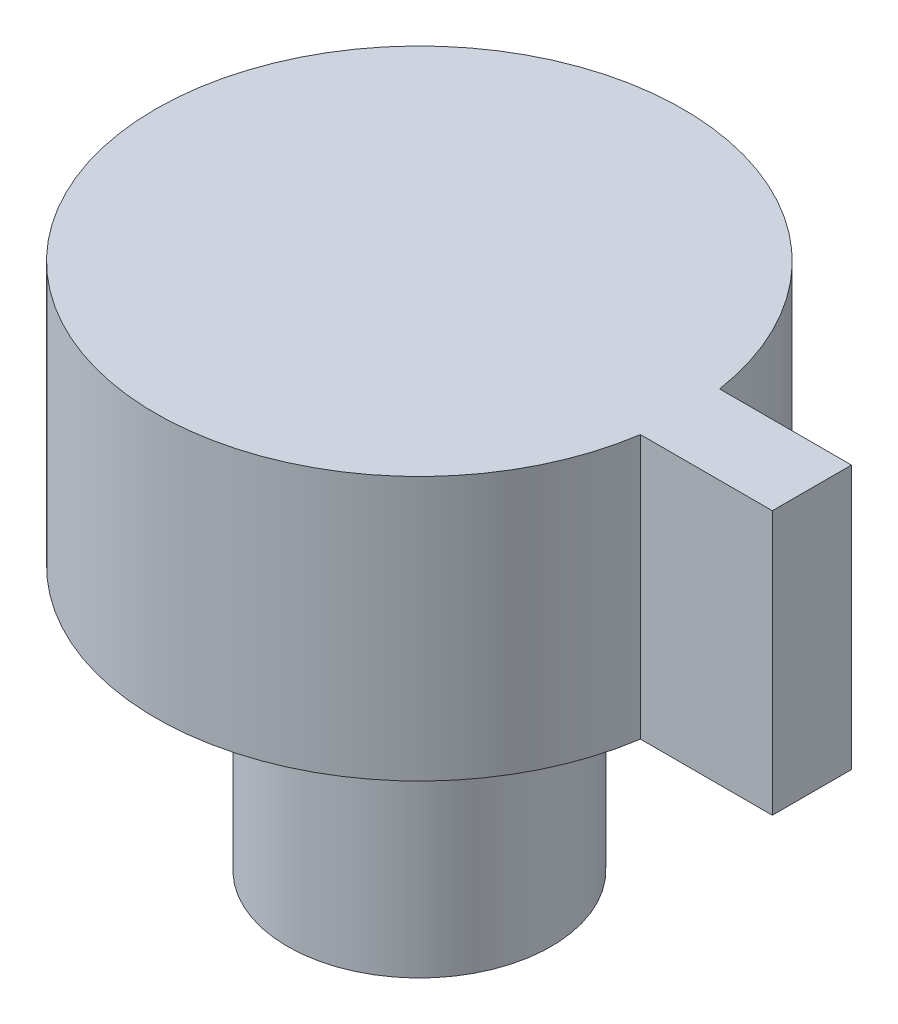
ISO-10303-21;
HEADER;
FILE_DESCRIPTION(('STEP AP214'),'2;1');
FILE_NAME('part.step','',(''),(''),'','','');
FILE_SCHEMA(('AUTOMOTIVE_DESIGN { 1 0 10303 214 1 1 1 1 }'));
ENDSEC;
DATA;
#1=APPLICATION_CONTEXT('core data for automotive mechanical design processes');
#2=APPLICATION_PROTOCOL_DEFINITION('international standard','automotive_design',2000,#1);
#3=PRODUCT_CONTEXT('',#1,'mechanical');
#4=PRODUCT('Part','Part','',(#3));
#5=PRODUCT_RELATED_PRODUCT_CATEGORY('part','',(#4));
#6=PRODUCT_DEFINITION_FORMATION('','',#4);
#7=PRODUCT_DEFINITION_CONTEXT('part definition',#1,'design');
#8=PRODUCT_DEFINITION('design','',#6,#7);
#9=PRODUCT_DEFINITION_SHAPE('','',#8);
#10=(LENGTH_UNIT() NAMED_UNIT(*) SI_UNIT(.MILLI.,.METRE.));
#11=(NAMED_UNIT(*) PLANE_ANGLE_UNIT() SI_UNIT($,.RADIAN.));
#12=(NAMED_UNIT(*) SI_UNIT($,.STERADIAN.) SOLID_ANGLE_UNIT());
#13=UNCERTAINTY_MEASURE_WITH_UNIT(LENGTH_MEASURE(1.E-05),#10,'distance_accuracy_value','');
#14=(GEOMETRIC_REPRESENTATION_CONTEXT(3) GLOBAL_UNCERTAINTY_ASSIGNED_CONTEXT((#13)) GLOBAL_UNIT_ASSIGNED_CONTEXT((#10,
#11,#12)) REPRESENTATION_CONTEXT('',''));
#15=CARTESIAN_POINT('',(0.,0.,0.));
#16=DIRECTION('',(0.,0.,1.));
#17=DIRECTION('',(1.,0.,0.));
#18=AXIS2_PLACEMENT_3D('',#15,#16,#17);
#19=CARTESIAN_POINT('',(0.,10.,16.2142782623037));
#20=DIRECTION('',(0.,0.,-1.));
#21=DIRECTION('',(-1.,0.,0.));
#22=AXIS2_PLACEMENT_3D('',#19,#20,#21);
#23=PLANE('',#22);
#24=DIRECTION('',(1.,0.,0.));
#25=VECTOR('',#24,1.);
#26=CARTESIAN_POINT('',(0.,0.,16.2142782623037));
#27=LINE('',#26,#25);
#28=CARTESIAN_POINT('',(-56.1699813359462,0.,16.2142782623037));
#29=VERTEX_POINT('',#28);
#30=CARTESIAN_POINT('',(-51.1699813359462,0.,16.2142782623037));
#31=VERTEX_POINT('',#30);
#32=EDGE_CURVE('E97',#29,#31,#27,.T.);
#33=ORIENTED_EDGE('',*,*,#32,.F.);
#34=DIRECTION('',(0.,-1.,0.));
#35=VECTOR('',#34,1.);
#36=CARTESIAN_POINT('',(-56.1699813359462,10.,16.2142782623037));
#37=LINE('',#36,#35);
#38=CARTESIAN_POINT('',(-56.1699813359462,10.,16.2142782623037));
#39=VERTEX_POINT('',#38);
#40=EDGE_CURVE('E11',#39,#29,#37,.T.);
#41=ORIENTED_EDGE('',*,*,#40,.F.);
#42=DIRECTION('',(1.,0.,0.));
#43=VECTOR('',#42,1.);
#44=CARTESIAN_POINT('',(0.,10.,16.2142782623037));
#45=LINE('',#44,#43);
#46=CARTESIAN_POINT('',(-51.1699813359462,10.,16.2142782623037));
#47=VERTEX_POINT('',#46);
#48=EDGE_CURVE('E82',#39,#47,#45,.T.);
#49=ORIENTED_EDGE('',*,*,#48,.T.);
#50=DIRECTION('',(0.,-1.,0.));
#51=VECTOR('',#50,1.);
#52=CARTESIAN_POINT('',(-51.1699813359462,10.,16.2142782623037));
#53=LINE('',#52,#51);
#54=EDGE_CURVE('E50',#47,#31,#53,.T.);
#55=ORIENTED_EDGE('',*,*,#54,.T.);
#56=EDGE_LOOP('',(#33,#41,#49,#55));
#57=FACE_BOUND('',#56,.T.);
#58=ADVANCED_FACE('F34',(#57),#23,.T.);
#59=CARTESIAN_POINT('',(-66.0533084074787,10.,17.7142782623037));
#60=DIRECTION('',(0.,-1.,0.));
#61=DIRECTION('',(0.,0.,-1.));
#62=AXIS2_PLACEMENT_3D('',#59,#60,#61);
#63=CYLINDRICAL_SURFACE('',#62,9.99650709012346);
#64=CARTESIAN_POINT('',(-66.0533084074787,0.,17.7142782623037));
#65=DIRECTION('',(0.,1.,0.));
#66=DIRECTION('',(0.,0.,1.));
#67=AXIS2_PLACEMENT_3D('',#64,#65,#66);
#68=CIRCLE('',#67,9.99650709012346);
#69=CARTESIAN_POINT('',(-56.1699813359462,0.,19.2142782623037));
#70=VERTEX_POINT('',#69);
#71=EDGE_CURVE('E88',#29,#70,#68,.T.);
#72=ORIENTED_EDGE('',*,*,#71,.T.);
#73=DIRECTION('',(0.,-1.,0.));
#74=VECTOR('',#73,1.);
#75=CARTESIAN_POINT('',(-56.1699813359462,10.,19.2142782623037));
#76=LINE('',#75,#74);
#77=CARTESIAN_POINT('',(-56.1699813359462,10.,19.2142782623037));
#78=VERTEX_POINT('',#77);
#79=EDGE_CURVE('E42',#78,#70,#76,.T.);
#80=ORIENTED_EDGE('',*,*,#79,.F.);
#81=CARTESIAN_POINT('',(-66.0533084074787,10.,17.7142782623037));
#82=DIRECTION('',(0.,1.,0.));
#83=DIRECTION('',(0.,0.,1.));
#84=AXIS2_PLACEMENT_3D('',#81,#82,#83);
#85=CIRCLE('',#84,9.99650709012346);
#86=EDGE_CURVE('E76',#39,#78,#85,.T.);
#87=ORIENTED_EDGE('',*,*,#86,.F.);
#88=ORIENTED_EDGE('',*,*,#40,.T.);
#89=EDGE_LOOP('',(#72,#80,#87,#88));
#90=FACE_BOUND('',#89,.T.);
#91=ADVANCED_FACE('F86',(#90),#63,.T.);
#92=CARTESIAN_POINT('',(0.,10.,19.2142782623037));
#93=DIRECTION('',(0.,0.,1.));
#94=DIRECTION('',(1.,0.,0.));
#95=AXIS2_PLACEMENT_3D('',#92,#93,#94);
#96=PLANE('',#95);
#97=DIRECTION('',(-1.,0.,0.));
#98=VECTOR('',#97,1.);
#99=CARTESIAN_POINT('',(0.,0.,19.2142782623037));
#100=LINE('',#99,#98);
#101=CARTESIAN_POINT('',(-51.1699813359462,0.,19.2142782623037));
#102=VERTEX_POINT('',#101);
#103=EDGE_CURVE('E101',#102,#70,#100,.T.);
#104=ORIENTED_EDGE('',*,*,#103,.F.);
#105=DIRECTION('',(0.,-1.,0.));
#106=VECTOR('',#105,1.);
#107=CARTESIAN_POINT('',(-51.1699813359462,10.,19.2142782623037));
#108=LINE('',#107,#106);
#109=CARTESIAN_POINT('',(-51.1699813359462,10.,19.2142782623037));
#110=VERTEX_POINT('',#109);
#111=EDGE_CURVE('E63',#110,#102,#108,.T.);
#112=ORIENTED_EDGE('',*,*,#111,.F.);
#113=DIRECTION('',(-1.,0.,0.));
#114=VECTOR('',#113,1.);
#115=CARTESIAN_POINT('',(0.,10.,19.2142782623037));
#116=LINE('',#115,#114);
#117=EDGE_CURVE('E81',#110,#78,#116,.T.);
#118=ORIENTED_EDGE('',*,*,#117,.T.);
#119=ORIENTED_EDGE('',*,*,#79,.T.);
#120=EDGE_LOOP('',(#104,#112,#118,#119));
#121=FACE_BOUND('',#120,.T.);
#122=ADVANCED_FACE('F91',(#121),#96,.T.);
#123=CARTESIAN_POINT('',(-51.1699813359462,10.,0.));
#124=DIRECTION('',(1.,0.,0.));
#125=DIRECTION('',(0.,0.,-1.));
#126=AXIS2_PLACEMENT_3D('',#123,#124,#125);
#127=PLANE('',#126);
#128=DIRECTION('',(0.,0.,1.));
#129=VECTOR('',#128,1.);
#130=CARTESIAN_POINT('',(-51.1699813359462,0.,0.));
#131=LINE('',#130,#129);
#132=EDGE_CURVE('E103',#31,#102,#131,.T.);
#133=ORIENTED_EDGE('',*,*,#132,.F.);
#134=ORIENTED_EDGE('',*,*,#54,.F.);
#135=DIRECTION('',(0.,0.,1.));
#136=VECTOR('',#135,1.);
#137=CARTESIAN_POINT('',(-51.1699813359462,10.,0.));
#138=LINE('',#137,#136);
#139=EDGE_CURVE('E92',#47,#110,#138,.T.);
#140=ORIENTED_EDGE('',*,*,#139,.T.);
#141=ORIENTED_EDGE('',*,*,#111,.T.);
#142=EDGE_LOOP('',(#133,#134,#140,#141));
#143=FACE_BOUND('',#142,.T.);
#144=ADVANCED_FACE('F130',(#143),#127,.T.);
#145=CARTESIAN_POINT('',(0.,10.,0.));
#146=DIRECTION('',(0.,1.,0.));
#147=DIRECTION('',(0.,0.,1.));
#148=AXIS2_PLACEMENT_3D('',#145,#146,#147);
#149=PLANE('',#148);
#150=ORIENTED_EDGE('',*,*,#48,.F.);
#151=ORIENTED_EDGE('',*,*,#86,.T.);
#152=ORIENTED_EDGE('',*,*,#117,.F.);
#153=ORIENTED_EDGE('',*,*,#139,.F.);
#154=EDGE_LOOP('',(#150,#151,#152,#153));
#155=FACE_BOUND('',#154,.T.);
#156=ADVANCED_FACE('F78',(#155),#149,.T.);
#157=CARTESIAN_POINT('',(0.,0.,0.));
#158=DIRECTION('',(0.,1.,0.));
#159=DIRECTION('',(0.,0.,1.));
#160=AXIS2_PLACEMENT_3D('',#157,#158,#159);
#161=PLANE('',#160);
#162=CARTESIAN_POINT('',(-66.0533084074787,0.,17.7142782623037));
#163=DIRECTION('',(0.,1.,0.));
#164=DIRECTION('',(0.,0.,1.));
#165=AXIS2_PLACEMENT_3D('',#162,#163,#164);
#166=CIRCLE('',#165,5.);
#167=CARTESIAN_POINT('',(-66.0533084074787,0.,22.7142782623036));
#168=VERTEX_POINT('',#167);
#169=EDGE_CURVE('E109',#168,#168,#166,.T.);
#170=ORIENTED_EDGE('',*,*,#169,.T.);
#171=EDGE_LOOP('',(#170));
#172=FACE_BOUND('',#171,.T.);
#173=ORIENTED_EDGE('',*,*,#32,.T.);
#174=ORIENTED_EDGE('',*,*,#132,.T.);
#175=ORIENTED_EDGE('',*,*,#103,.T.);
#176=ORIENTED_EDGE('',*,*,#71,.F.);
#177=EDGE_LOOP('',(#173,#174,#175,#176));
#178=FACE_BOUND('',#177,.T.);
#179=ADVANCED_FACE('F124',(#172,#178),#161,.F.);
#180=CARTESIAN_POINT('',(-66.0533084074787,-10.,17.7142782623037));
#181=DIRECTION('',(0.,1.,0.));
#182=DIRECTION('',(0.,0.,1.));
#183=AXIS2_PLACEMENT_3D('',#180,#181,#182);
#184=CYLINDRICAL_SURFACE('',#183,5.);
#185=CARTESIAN_POINT('',(-66.0533084074787,-10.,17.7142782623037));
#186=DIRECTION('',(0.,1.,0.));
#187=DIRECTION('',(0.,0.,1.));
#188=AXIS2_PLACEMENT_3D('',#185,#186,#187);
#189=CIRCLE('',#188,5.);
#190=CARTESIAN_POINT('',(-66.0533084074787,-10.,22.7142782623036));
#191=VERTEX_POINT('',#190);
#192=EDGE_CURVE('E99',#191,#191,#189,.T.);
#193=ORIENTED_EDGE('',*,*,#192,.T.);
#194=EDGE_LOOP('',(#193));
#195=FACE_BOUND('',#194,.T.);
#196=ORIENTED_EDGE('',*,*,#169,.F.);
#197=EDGE_LOOP('',(#196));
#198=FACE_BOUND('',#197,.T.);
#199=ADVANCED_FACE('F115',(#195,#198),#184,.T.);
#200=CARTESIAN_POINT('',(0.,-10.,0.));
#201=DIRECTION('',(0.,1.,0.));
#202=DIRECTION('',(0.,0.,1.));
#203=AXIS2_PLACEMENT_3D('',#200,#201,#202);
#204=PLANE('',#203);
#205=ORIENTED_EDGE('',*,*,#192,.F.);
#206=EDGE_LOOP('',(#205));
#207=FACE_BOUND('',#206,.T.);
#208=ADVANCED_FACE('F118',(#207),#204,.F.);
#209=CLOSED_SHELL('',(#58,#91,#122,#144,#156,#179,#199,#208));
#210=MANIFOLD_SOLID_BREP('B2',#209);
#211=ADVANCED_BREP_SHAPE_REPRESENTATION('',(#18,#210),#14);
#212=SHAPE_DEFINITION_REPRESENTATION(#9,#211);
ENDSEC;
END-ISO-10303-21;
